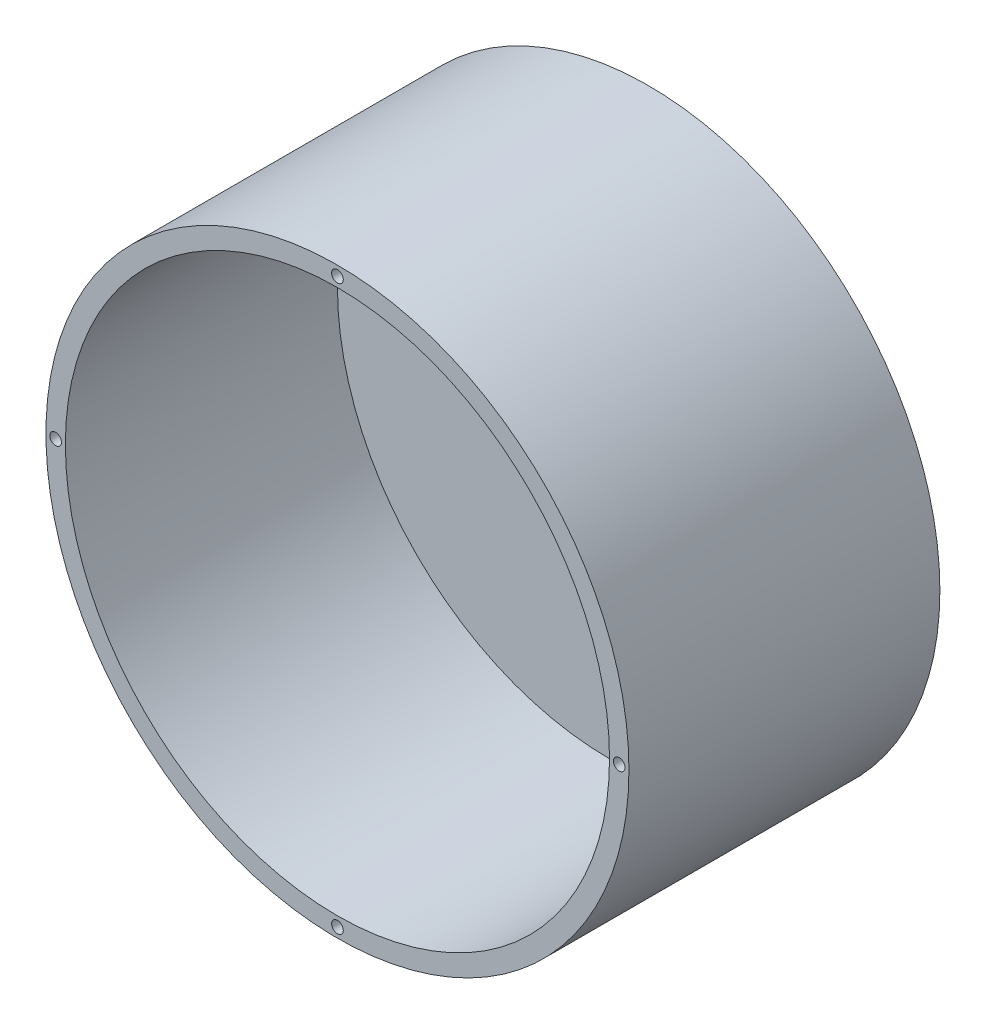
ISO-10303-21;
HEADER;
FILE_DESCRIPTION(('STEP AP214'),'2;1');
FILE_NAME('part.step','',(''),(''),'','','');
FILE_SCHEMA(('AUTOMOTIVE_DESIGN { 1 0 10303 214 1 1 1 1 }'));
ENDSEC;
DATA;
#1=APPLICATION_CONTEXT('core data for automotive mechanical design processes');
#2=APPLICATION_PROTOCOL_DEFINITION('international standard','automotive_design',2000,#1);
#3=PRODUCT_CONTEXT('',#1,'mechanical');
#4=PRODUCT('Part','Part','',(#3));
#5=PRODUCT_RELATED_PRODUCT_CATEGORY('part','',(#4));
#6=PRODUCT_DEFINITION_FORMATION('','',#4);
#7=PRODUCT_DEFINITION_CONTEXT('part definition',#1,'design');
#8=PRODUCT_DEFINITION('design','',#6,#7);
#9=PRODUCT_DEFINITION_SHAPE('','',#8);
#10=(LENGTH_UNIT() NAMED_UNIT(*) SI_UNIT(.MILLI.,.METRE.));
#11=(NAMED_UNIT(*) PLANE_ANGLE_UNIT() SI_UNIT($,.RADIAN.));
#12=(NAMED_UNIT(*) SI_UNIT($,.STERADIAN.) SOLID_ANGLE_UNIT());
#13=UNCERTAINTY_MEASURE_WITH_UNIT(LENGTH_MEASURE(1.E-05),#10,'distance_accuracy_value','');
#14=(GEOMETRIC_REPRESENTATION_CONTEXT(3) GLOBAL_UNCERTAINTY_ASSIGNED_CONTEXT((#13)) GLOBAL_UNIT_ASSIGNED_CONTEXT((#10,
#11,#12)) REPRESENTATION_CONTEXT('',''));
#15=CARTESIAN_POINT('',(0.,0.,0.));
#16=DIRECTION('',(0.,0.,1.));
#17=DIRECTION('',(1.,0.,0.));
#18=AXIS2_PLACEMENT_3D('',#15,#16,#17);
#19=CARTESIAN_POINT('',(0.,0.,40.));
#20=DIRECTION('',(0.,0.,-1.));
#21=DIRECTION('',(-1.,0.,0.));
#22=AXIS2_PLACEMENT_3D('',#19,#20,#21);
#23=CYLINDRICAL_SURFACE('',#22,35.);
#24=CARTESIAN_POINT('',(0.,0.,40.));
#25=DIRECTION('',(0.,0.,1.));
#26=DIRECTION('',(1.,0.,0.));
#27=AXIS2_PLACEMENT_3D('',#24,#25,#26);
#28=CIRCLE('',#27,35.);
#29=CARTESIAN_POINT('',(35.,0.,40.));
#30=VERTEX_POINT('',#29);
#31=EDGE_CURVE('E61',#30,#30,#28,.T.);
#32=ORIENTED_EDGE('',*,*,#31,.T.);
#33=EDGE_LOOP('',(#32));
#34=FACE_BOUND('',#33,.T.);
#35=CARTESIAN_POINT('',(0.,0.,5.));
#36=DIRECTION('',(0.,0.,-1.));
#37=DIRECTION('',(-1.,0.,0.));
#38=AXIS2_PLACEMENT_3D('',#35,#36,#37);
#39=CIRCLE('',#38,35.);
#40=CARTESIAN_POINT('',(-35.,0.,5.));
#41=VERTEX_POINT('',#40);
#42=EDGE_CURVE('E66',#41,#41,#39,.T.);
#43=ORIENTED_EDGE('',*,*,#42,.T.);
#44=EDGE_LOOP('',(#43));
#45=FACE_BOUND('',#44,.T.);
#46=ADVANCED_FACE('F48',(#34,#45),#23,.F.);
#47=CARTESIAN_POINT('',(0.,0.,40.));
#48=DIRECTION('',(0.,0.,1.));
#49=DIRECTION('',(1.,0.,0.));
#50=AXIS2_PLACEMENT_3D('',#47,#48,#49);
#51=PLANE('',#50);
#52=CARTESIAN_POINT('',(0.,36.25,40.));
#53=DIRECTION('',(0.,0.,1.));
#54=DIRECTION('',(1.,0.,0.));
#55=AXIS2_PLACEMENT_3D('',#52,#53,#54);
#56=CIRCLE('',#55,0.750000000000001);
#57=CARTESIAN_POINT('',(0.750000000000001,36.25,40.));
#58=VERTEX_POINT('',#57);
#59=EDGE_CURVE('E95',#58,#58,#56,.T.);
#60=ORIENTED_EDGE('',*,*,#59,.F.);
#61=EDGE_LOOP('',(#60));
#62=FACE_BOUND('',#61,.T.);
#63=CARTESIAN_POINT('',(36.25,-1.26566198533064E-13,40.));
#64=DIRECTION('',(0.,0.,1.));
#65=DIRECTION('',(1.,0.,0.));
#66=AXIS2_PLACEMENT_3D('',#63,#64,#65);
#67=CIRCLE('',#66,0.750000000000002);
#68=CARTESIAN_POINT('',(37.,-1.26566198533064E-13,40.));
#69=VERTEX_POINT('',#68);
#70=EDGE_CURVE('E91',#69,#69,#67,.T.);
#71=ORIENTED_EDGE('',*,*,#70,.F.);
#72=EDGE_LOOP('',(#71));
#73=FACE_BOUND('',#72,.T.);
#74=CARTESIAN_POINT('',(-2.53132397066127E-13,-36.25,40.));
#75=DIRECTION('',(0.,0.,1.));
#76=DIRECTION('',(1.,0.,0.));
#77=AXIS2_PLACEMENT_3D('',#74,#75,#76);
#78=CIRCLE('',#77,0.75);
#79=CARTESIAN_POINT('',(0.749999999999747,-36.25,40.));
#80=VERTEX_POINT('',#79);
#81=EDGE_CURVE('E83',#80,#80,#78,.T.);
#82=ORIENTED_EDGE('',*,*,#81,.F.);
#83=EDGE_LOOP('',(#82));
#84=FACE_BOUND('',#83,.T.);
#85=CARTESIAN_POINT('',(-36.25,3.79698595599191E-13,40.));
#86=DIRECTION('',(0.,0.,1.));
#87=DIRECTION('',(1.,0.,0.));
#88=AXIS2_PLACEMENT_3D('',#85,#86,#87);
#89=CIRCLE('',#88,0.750000000000001);
#90=CARTESIAN_POINT('',(-35.5,3.79698595599191E-13,40.));
#91=VERTEX_POINT('',#90);
#92=EDGE_CURVE('E75',#91,#91,#89,.T.);
#93=ORIENTED_EDGE('',*,*,#92,.F.);
#94=EDGE_LOOP('',(#93));
#95=FACE_BOUND('',#94,.T.);
#96=CARTESIAN_POINT('',(0.,0.,40.));
#97=DIRECTION('',(0.,0.,1.));
#98=DIRECTION('',(1.,0.,0.));
#99=AXIS2_PLACEMENT_3D('',#96,#97,#98);
#100=CIRCLE('',#99,37.5);
#101=CARTESIAN_POINT('',(37.5,0.,40.));
#102=VERTEX_POINT('',#101);
#103=EDGE_CURVE('E11',#102,#102,#100,.T.);
#104=ORIENTED_EDGE('',*,*,#103,.T.);
#105=EDGE_LOOP('',(#104));
#106=FACE_BOUND('',#105,.T.);
#107=ORIENTED_EDGE('',*,*,#31,.F.);
#108=EDGE_LOOP('',(#107));
#109=FACE_BOUND('',#108,.T.);
#110=ADVANCED_FACE('F112',(#62,#73,#84,#95,#106,#109),#51,.T.);
#111=CARTESIAN_POINT('',(0.,0.,0.));
#112=DIRECTION('',(0.,0.,1.));
#113=DIRECTION('',(1.,0.,0.));
#114=AXIS2_PLACEMENT_3D('',#111,#112,#113);
#115=PLANE('',#114);
#116=CARTESIAN_POINT('',(0.,0.,0.));
#117=DIRECTION('',(0.,0.,1.));
#118=DIRECTION('',(1.,0.,0.));
#119=AXIS2_PLACEMENT_3D('',#116,#117,#118);
#120=CIRCLE('',#119,37.5);
#121=CARTESIAN_POINT('',(37.5,0.,0.));
#122=VERTEX_POINT('',#121);
#123=EDGE_CURVE('E52',#122,#122,#120,.T.);
#124=ORIENTED_EDGE('',*,*,#123,.F.);
#125=EDGE_LOOP('',(#124));
#126=FACE_BOUND('',#125,.T.);
#127=ADVANCED_FACE('F115',(#126),#115,.F.);
#128=CARTESIAN_POINT('',(0.,0.,40.));
#129=DIRECTION('',(0.,0.,-1.));
#130=DIRECTION('',(-1.,0.,0.));
#131=AXIS2_PLACEMENT_3D('',#128,#129,#130);
#132=CYLINDRICAL_SURFACE('',#131,37.5);
#133=ORIENTED_EDGE('',*,*,#103,.F.);
#134=EDGE_LOOP('',(#133));
#135=FACE_BOUND('',#134,.T.);
#136=ORIENTED_EDGE('',*,*,#123,.T.);
#137=EDGE_LOOP('',(#136));
#138=FACE_BOUND('',#137,.T.);
#139=ADVANCED_FACE('F50',(#135,#138),#132,.T.);
#140=CARTESIAN_POINT('',(0.,0.,5.));
#141=DIRECTION('',(0.,0.,-1.));
#142=DIRECTION('',(-1.,0.,0.));
#143=AXIS2_PLACEMENT_3D('',#140,#141,#142);
#144=PLANE('',#143);
#145=ORIENTED_EDGE('',*,*,#42,.F.);
#146=EDGE_LOOP('',(#145));
#147=FACE_BOUND('',#146,.T.);
#148=ADVANCED_FACE('F130',(#147),#144,.F.);
#149=CARTESIAN_POINT('',(-36.25,3.79698595599191E-13,35.));
#150=DIRECTION('',(0.,0.,1.));
#151=DIRECTION('',(1.,0.,0.));
#152=AXIS2_PLACEMENT_3D('',#149,#150,#151);
#153=CYLINDRICAL_SURFACE('',#152,0.750000000000001);
#154=CARTESIAN_POINT('',(-36.25,3.79698595599191E-13,35.));
#155=DIRECTION('',(0.,0.,1.));
#156=DIRECTION('',(1.,0.,0.));
#157=AXIS2_PLACEMENT_3D('',#154,#155,#156);
#158=CIRCLE('',#157,0.750000000000001);
#159=CARTESIAN_POINT('',(-35.5,3.79698595599191E-13,35.));
#160=VERTEX_POINT('',#159);
#161=EDGE_CURVE('E71',#160,#160,#158,.T.);
#162=ORIENTED_EDGE('',*,*,#161,.F.);
#163=EDGE_LOOP('',(#162));
#164=FACE_BOUND('',#163,.T.);
#165=ORIENTED_EDGE('',*,*,#92,.T.);
#166=EDGE_LOOP('',(#165));
#167=FACE_BOUND('',#166,.T.);
#168=ADVANCED_FACE('F132',(#164,#167),#153,.F.);
#169=CARTESIAN_POINT('',(-36.25,3.79698595599191E-13,35.));
#170=DIRECTION('',(0.,0.,1.));
#171=DIRECTION('',(1.,0.,0.));
#172=AXIS2_PLACEMENT_3D('',#169,#170,#171);
#173=PLANE('',#172);
#174=ORIENTED_EDGE('',*,*,#161,.T.);
#175=EDGE_LOOP('',(#174));
#176=FACE_BOUND('',#175,.T.);
#177=ADVANCED_FACE('F138',(#176),#173,.T.);
#178=CARTESIAN_POINT('',(-2.53132397066127E-13,-36.25,35.));
#179=DIRECTION('',(0.,0.,1.));
#180=DIRECTION('',(1.,0.,0.));
#181=AXIS2_PLACEMENT_3D('',#178,#179,#180);
#182=CYLINDRICAL_SURFACE('',#181,0.75);
#183=CARTESIAN_POINT('',(-2.53132397066127E-13,-36.25,35.));
#184=DIRECTION('',(0.,0.,1.));
#185=DIRECTION('',(1.,0.,0.));
#186=AXIS2_PLACEMENT_3D('',#183,#184,#185);
#187=CIRCLE('',#186,0.75);
#188=CARTESIAN_POINT('',(0.749999999999747,-36.25,35.));
#189=VERTEX_POINT('',#188);
#190=EDGE_CURVE('E79',#189,#189,#187,.T.);
#191=ORIENTED_EDGE('',*,*,#190,.F.);
#192=EDGE_LOOP('',(#191));
#193=FACE_BOUND('',#192,.T.);
#194=ORIENTED_EDGE('',*,*,#81,.T.);
#195=EDGE_LOOP('',(#194));
#196=FACE_BOUND('',#195,.T.);
#197=ADVANCED_FACE('F184',(#193,#196),#182,.F.);
#198=CARTESIAN_POINT('',(-2.53132397066127E-13,-36.25,35.));
#199=DIRECTION('',(0.,0.,1.));
#200=DIRECTION('',(1.,0.,0.));
#201=AXIS2_PLACEMENT_3D('',#198,#199,#200);
#202=PLANE('',#201);
#203=ORIENTED_EDGE('',*,*,#190,.T.);
#204=EDGE_LOOP('',(#203));
#205=FACE_BOUND('',#204,.T.);
#206=ADVANCED_FACE('F192',(#205),#202,.T.);
#207=CARTESIAN_POINT('',(36.25,-1.26566198533064E-13,35.));
#208=DIRECTION('',(0.,0.,1.));
#209=DIRECTION('',(1.,0.,0.));
#210=AXIS2_PLACEMENT_3D('',#207,#208,#209);
#211=CYLINDRICAL_SURFACE('',#210,0.750000000000002);
#212=CARTESIAN_POINT('',(36.25,-1.26566198533064E-13,35.));
#213=DIRECTION('',(0.,0.,1.));
#214=DIRECTION('',(1.,0.,0.));
#215=AXIS2_PLACEMENT_3D('',#212,#213,#214);
#216=CIRCLE('',#215,0.750000000000002);
#217=CARTESIAN_POINT('',(37.,-1.26566198533064E-13,35.));
#218=VERTEX_POINT('',#217);
#219=EDGE_CURVE('E87',#218,#218,#216,.T.);
#220=ORIENTED_EDGE('',*,*,#219,.F.);
#221=EDGE_LOOP('',(#220));
#222=FACE_BOUND('',#221,.T.);
#223=ORIENTED_EDGE('',*,*,#70,.T.);
#224=EDGE_LOOP('',(#223));
#225=FACE_BOUND('',#224,.T.);
#226=ADVANCED_FACE('F201',(#222,#225),#211,.F.);
#227=CARTESIAN_POINT('',(36.25,-1.26566198533064E-13,35.));
#228=DIRECTION('',(0.,0.,1.));
#229=DIRECTION('',(1.,0.,0.));
#230=AXIS2_PLACEMENT_3D('',#227,#228,#229);
#231=PLANE('',#230);
#232=ORIENTED_EDGE('',*,*,#219,.T.);
#233=EDGE_LOOP('',(#232));
#234=FACE_BOUND('',#233,.T.);
#235=ADVANCED_FACE('F108',(#234),#231,.T.);
#236=CARTESIAN_POINT('',(0.,36.25,35.));
#237=DIRECTION('',(0.,0.,1.));
#238=DIRECTION('',(1.,0.,0.));
#239=AXIS2_PLACEMENT_3D('',#236,#237,#238);
#240=CYLINDRICAL_SURFACE('',#239,0.750000000000001);
#241=CARTESIAN_POINT('',(0.,36.25,35.));
#242=DIRECTION('',(0.,0.,1.));
#243=DIRECTION('',(1.,0.,0.));
#244=AXIS2_PLACEMENT_3D('',#241,#242,#243);
#245=CIRCLE('',#244,0.750000000000001);
#246=CARTESIAN_POINT('',(0.750000000000001,36.25,35.));
#247=VERTEX_POINT('',#246);
#248=EDGE_CURVE('E70',#247,#247,#245,.T.);
#249=ORIENTED_EDGE('',*,*,#248,.F.);
#250=EDGE_LOOP('',(#249));
#251=FACE_BOUND('',#250,.T.);
#252=ORIENTED_EDGE('',*,*,#59,.T.);
#253=EDGE_LOOP('',(#252));
#254=FACE_BOUND('',#253,.T.);
#255=ADVANCED_FACE('F105',(#251,#254),#240,.F.);
#256=CARTESIAN_POINT('',(0.,36.25,35.));
#257=DIRECTION('',(0.,0.,1.));
#258=DIRECTION('',(1.,0.,0.));
#259=AXIS2_PLACEMENT_3D('',#256,#257,#258);
#260=PLANE('',#259);
#261=ORIENTED_EDGE('',*,*,#248,.T.);
#262=EDGE_LOOP('',(#261));
#263=FACE_BOUND('',#262,.T.);
#264=ADVANCED_FACE('F103',(#263),#260,.T.);
#265=CLOSED_SHELL('',(#46,#110,#127,#139,#148,#168,#177,#197,#206,#226,#235,#255,#264));
#266=MANIFOLD_SOLID_BREP('B2',#265);
#267=ADVANCED_BREP_SHAPE_REPRESENTATION('',(#18,#266),#14);
#268=SHAPE_DEFINITION_REPRESENTATION(#9,#267);
ENDSEC;
END-ISO-10303-21;
